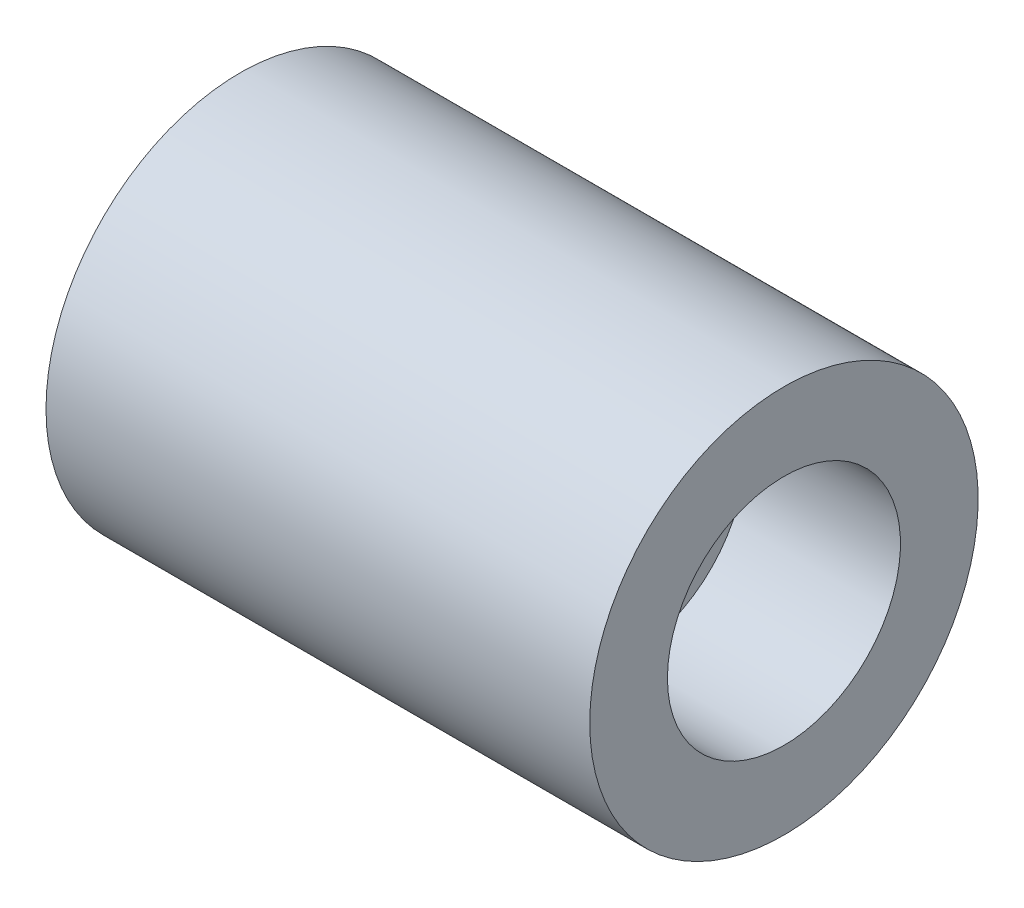
ISO-10303-21;
HEADER;
FILE_DESCRIPTION(('STEP AP214'),'2;1');
FILE_NAME('part.step','',(''),(''),'','','');
FILE_SCHEMA(('AUTOMOTIVE_DESIGN { 1 0 10303 214 1 1 1 1 }'));
ENDSEC;
DATA;
#1=APPLICATION_CONTEXT('core data for automotive mechanical design processes');
#2=APPLICATION_PROTOCOL_DEFINITION('international standard','automotive_design',2000,#1);
#3=PRODUCT_CONTEXT('',#1,'mechanical');
#4=PRODUCT('Part','Part','',(#3));
#5=PRODUCT_RELATED_PRODUCT_CATEGORY('part','',(#4));
#6=PRODUCT_DEFINITION_FORMATION('','',#4);
#7=PRODUCT_DEFINITION_CONTEXT('part definition',#1,'design');
#8=PRODUCT_DEFINITION('design','',#6,#7);
#9=PRODUCT_DEFINITION_SHAPE('','',#8);
#10=(LENGTH_UNIT() NAMED_UNIT(*) SI_UNIT(.MILLI.,.METRE.));
#11=(NAMED_UNIT(*) PLANE_ANGLE_UNIT() SI_UNIT($,.RADIAN.));
#12=(NAMED_UNIT(*) SI_UNIT($,.STERADIAN.) SOLID_ANGLE_UNIT());
#13=UNCERTAINTY_MEASURE_WITH_UNIT(LENGTH_MEASURE(1.E-05),#10,'distance_accuracy_value','');
#14=(GEOMETRIC_REPRESENTATION_CONTEXT(3) GLOBAL_UNCERTAINTY_ASSIGNED_CONTEXT((#13)) GLOBAL_UNIT_ASSIGNED_CONTEXT((#10,
#11,#12)) REPRESENTATION_CONTEXT('',''));
#15=CARTESIAN_POINT('',(0.,0.,0.));
#16=DIRECTION('',(0.,0.,1.));
#17=DIRECTION('',(1.,0.,0.));
#18=AXIS2_PLACEMENT_3D('',#15,#16,#17);
#19=CARTESIAN_POINT('',(-20.,0.,0.));
#20=DIRECTION('',(-1.,0.,0.));
#21=DIRECTION('',(0.,0.,1.));
#22=AXIS2_PLACEMENT_3D('',#19,#20,#21);
#23=PLANE('',#22);
#24=CARTESIAN_POINT('',(-20.,0.,0.));
#25=DIRECTION('',(-1.,0.,0.));
#26=DIRECTION('',(0.,0.,1.));
#27=AXIS2_PLACEMENT_3D('',#24,#25,#26);
#28=CIRCLE('',#27,50.);
#29=CARTESIAN_POINT('',(-20.,0.,50.));
#30=VERTEX_POINT('',#29);
#31=EDGE_CURVE('E64',#30,#30,#28,.T.);
#32=ORIENTED_EDGE('',*,*,#31,.T.);
#33=EDGE_LOOP('',(#32));
#34=FACE_BOUND('',#33,.T.);
#35=ADVANCED_FACE('F37',(#34),#23,.T.);
#36=CARTESIAN_POINT('',(0.,0.,0.));
#37=DIRECTION('',(-1.,0.,0.));
#38=DIRECTION('',(0.,0.,1.));
#39=AXIS2_PLACEMENT_3D('',#36,#37,#38);
#40=PLANE('',#39);
#41=CARTESIAN_POINT('',(0.,0.,0.));
#42=DIRECTION('',(-1.,0.,0.));
#43=DIRECTION('',(0.,0.,1.));
#44=AXIS2_PLACEMENT_3D('',#41,#42,#43);
#45=CIRCLE('',#44,10.);
#46=CARTESIAN_POINT('',(0.,0.,10.));
#47=VERTEX_POINT('',#46);
#48=EDGE_CURVE('E10',#47,#47,#45,.T.);
#49=ORIENTED_EDGE('',*,*,#48,.F.);
#50=EDGE_LOOP('',(#49));
#51=FACE_BOUND('',#50,.T.);
#52=ADVANCED_FACE('F82',(#51),#40,.F.);
#53=CARTESIAN_POINT('',(-155.228470779968,0.,0.));
#54=DIRECTION('',(-1.,0.,0.));
#55=DIRECTION('',(0.,0.,1.));
#56=AXIS2_PLACEMENT_3D('',#53,#54,#55);
#57=CYLINDRICAL_SURFACE('',#56,10.);
#58=CARTESIAN_POINT('',(80.,0.,0.));
#59=DIRECTION('',(-1.,0.,0.));
#60=DIRECTION('',(0.,0.,1.));
#61=AXIS2_PLACEMENT_3D('',#58,#59,#60);
#62=CIRCLE('',#61,10.);
#63=CARTESIAN_POINT('',(80.,0.,10.));
#64=VERTEX_POINT('',#63);
#65=EDGE_CURVE('E44',#64,#64,#62,.T.);
#66=ORIENTED_EDGE('',*,*,#65,.F.);
#67=EDGE_LOOP('',(#66));
#68=FACE_BOUND('',#67,.T.);
#69=ORIENTED_EDGE('',*,*,#48,.T.);
#70=EDGE_LOOP('',(#69));
#71=FACE_BOUND('',#70,.T.);
#72=ADVANCED_FACE('F86',(#68,#71),#57,.F.);
#73=CARTESIAN_POINT('',(80.,0.,0.));
#74=DIRECTION('',(-1.,0.,0.));
#75=DIRECTION('',(0.,0.,1.));
#76=AXIS2_PLACEMENT_3D('',#73,#74,#75);
#77=PLANE('',#76);
#78=CARTESIAN_POINT('',(80.,0.,0.));
#79=DIRECTION('',(-1.,0.,0.));
#80=DIRECTION('',(0.,0.,1.));
#81=AXIS2_PLACEMENT_3D('',#78,#79,#80);
#82=CIRCLE('',#81,30.);
#83=CARTESIAN_POINT('',(80.,0.,30.));
#84=VERTEX_POINT('',#83);
#85=EDGE_CURVE('E49',#84,#84,#82,.T.);
#86=ORIENTED_EDGE('',*,*,#85,.F.);
#87=EDGE_LOOP('',(#86));
#88=FACE_BOUND('',#87,.T.);
#89=ORIENTED_EDGE('',*,*,#65,.T.);
#90=EDGE_LOOP('',(#89));
#91=FACE_BOUND('',#90,.T.);
#92=ADVANCED_FACE('F91',(#88,#91),#77,.F.);
#93=CARTESIAN_POINT('',(-155.228470779968,0.,0.));
#94=DIRECTION('',(-1.,0.,0.));
#95=DIRECTION('',(0.,0.,1.));
#96=AXIS2_PLACEMENT_3D('',#93,#94,#95);
#97=CYLINDRICAL_SURFACE('',#96,30.);
#98=CARTESIAN_POINT('',(120.,0.,0.));
#99=DIRECTION('',(-1.,0.,0.));
#100=DIRECTION('',(0.,0.,1.));
#101=AXIS2_PLACEMENT_3D('',#98,#99,#100);
#102=CIRCLE('',#101,30.);
#103=CARTESIAN_POINT('',(120.,0.,30.));
#104=VERTEX_POINT('',#103);
#105=EDGE_CURVE('E54',#104,#104,#102,.T.);
#106=ORIENTED_EDGE('',*,*,#105,.F.);
#107=EDGE_LOOP('',(#106));
#108=FACE_BOUND('',#107,.T.);
#109=ORIENTED_EDGE('',*,*,#85,.T.);
#110=EDGE_LOOP('',(#109));
#111=FACE_BOUND('',#110,.T.);
#112=ADVANCED_FACE('F78',(#108,#111),#97,.F.);
#113=CARTESIAN_POINT('',(120.,0.,0.));
#114=DIRECTION('',(1.,0.,0.));
#115=DIRECTION('',(0.,0.,-1.));
#116=AXIS2_PLACEMENT_3D('',#113,#114,#115);
#117=PLANE('',#116);
#118=ORIENTED_EDGE('',*,*,#105,.T.);
#119=EDGE_LOOP('',(#118));
#120=FACE_BOUND('',#119,.T.);
#121=CARTESIAN_POINT('',(120.,0.,0.));
#122=DIRECTION('',(-1.,0.,0.));
#123=DIRECTION('',(0.,0.,1.));
#124=AXIS2_PLACEMENT_3D('',#121,#122,#123);
#125=CIRCLE('',#124,50.);
#126=CARTESIAN_POINT('',(120.,0.,50.));
#127=VERTEX_POINT('',#126);
#128=EDGE_CURVE('E60',#127,#127,#125,.T.);
#129=ORIENTED_EDGE('',*,*,#128,.F.);
#130=EDGE_LOOP('',(#129));
#131=FACE_BOUND('',#130,.T.);
#132=ADVANCED_FACE('F72',(#120,#131),#117,.T.);
#133=CARTESIAN_POINT('',(-155.228470779968,0.,0.));
#134=DIRECTION('',(-1.,0.,0.));
#135=DIRECTION('',(0.,0.,1.));
#136=AXIS2_PLACEMENT_3D('',#133,#134,#135);
#137=CYLINDRICAL_SURFACE('',#136,50.);
#138=ORIENTED_EDGE('',*,*,#128,.T.);
#139=EDGE_LOOP('',(#138));
#140=FACE_BOUND('',#139,.T.);
#141=ORIENTED_EDGE('',*,*,#31,.F.);
#142=EDGE_LOOP('',(#141));
#143=FACE_BOUND('',#142,.T.);
#144=ADVANCED_FACE('F70',(#140,#143),#137,.T.);
#145=CLOSED_SHELL('',(#35,#52,#72,#92,#112,#132,#144));
#146=MANIFOLD_SOLID_BREP('B2',#145);
#147=ADVANCED_BREP_SHAPE_REPRESENTATION('',(#18,#146),#14);
#148=SHAPE_DEFINITION_REPRESENTATION(#9,#147);
ENDSEC;
END-ISO-10303-21;
